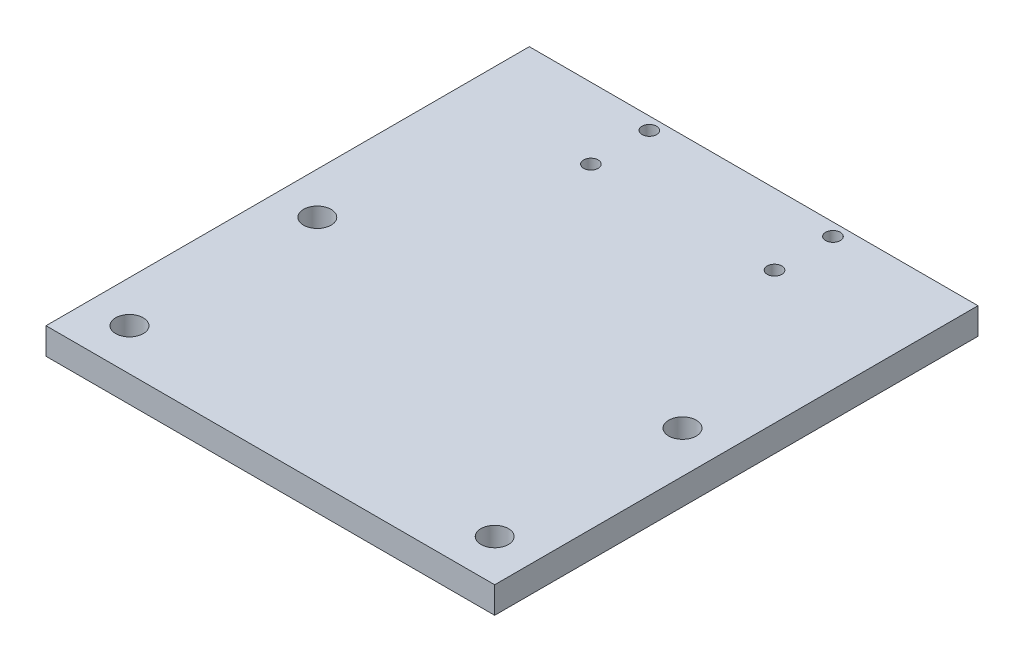
ISO-10303-21;
HEADER;
FILE_DESCRIPTION(('STEP AP214'),'2;1');
FILE_NAME('part.step','',(''),(''),'','','');
FILE_SCHEMA(('AUTOMOTIVE_DESIGN { 1 0 10303 214 1 1 1 1 }'));
ENDSEC;
DATA;
#1=APPLICATION_CONTEXT('core data for automotive mechanical design processes');
#2=APPLICATION_PROTOCOL_DEFINITION('international standard','automotive_design',2000,#1);
#3=PRODUCT_CONTEXT('',#1,'mechanical');
#4=PRODUCT('Part','Part','',(#3));
#5=PRODUCT_RELATED_PRODUCT_CATEGORY('part','',(#4));
#6=PRODUCT_DEFINITION_FORMATION('','',#4);
#7=PRODUCT_DEFINITION_CONTEXT('part definition',#1,'design');
#8=PRODUCT_DEFINITION('design','',#6,#7);
#9=PRODUCT_DEFINITION_SHAPE('','',#8);
#10=(LENGTH_UNIT() NAMED_UNIT(*) SI_UNIT(.MILLI.,.METRE.));
#11=(NAMED_UNIT(*) PLANE_ANGLE_UNIT() SI_UNIT($,.RADIAN.));
#12=(NAMED_UNIT(*) SI_UNIT($,.STERADIAN.) SOLID_ANGLE_UNIT());
#13=UNCERTAINTY_MEASURE_WITH_UNIT(LENGTH_MEASURE(1.E-05),#10,'distance_accuracy_value','');
#14=(GEOMETRIC_REPRESENTATION_CONTEXT(3) GLOBAL_UNCERTAINTY_ASSIGNED_CONTEXT((#13)) GLOBAL_UNIT_ASSIGNED_CONTEXT((#10,
#11,#12)) REPRESENTATION_CONTEXT('',''));
#15=CARTESIAN_POINT('',(0.,0.,0.));
#16=DIRECTION('',(0.,0.,1.));
#17=DIRECTION('',(1.,0.,0.));
#18=AXIS2_PLACEMENT_3D('',#15,#16,#17);
#19=CARTESIAN_POINT('',(0.,6.35,0.));
#20=DIRECTION('',(0.,-1.,0.));
#21=DIRECTION('',(0.,0.,-1.));
#22=AXIS2_PLACEMENT_3D('',#19,#20,#21);
#23=PLANE('',#22);
#24=DIRECTION('',(0.,0.,1.));
#25=VECTOR('',#24,1.);
#26=CARTESIAN_POINT('',(0.,6.35,0.));
#27=LINE('',#26,#25);
#28=CARTESIAN_POINT('',(0.,6.35,-115.8));
#29=VERTEX_POINT('',#28);
#30=CARTESIAN_POINT('',(0.,6.35,0.));
#31=VERTEX_POINT('',#30);
#32=EDGE_CURVE('E96',#29,#31,#27,.T.);
#33=ORIENTED_EDGE('',*,*,#32,.T.);
#34=DIRECTION('',(1.,0.,0.));
#35=VECTOR('',#34,1.);
#36=CARTESIAN_POINT('',(0.,6.35,0.));
#37=LINE('',#36,#35);
#38=CARTESIAN_POINT('',(107.5,6.35,0.));
#39=VERTEX_POINT('',#38);
#40=EDGE_CURVE('E91',#31,#39,#37,.T.);
#41=ORIENTED_EDGE('',*,*,#40,.T.);
#42=DIRECTION('',(0.,0.,-1.));
#43=VECTOR('',#42,1.);
#44=CARTESIAN_POINT('',(107.5,6.35,0.));
#45=LINE('',#44,#43);
#46=CARTESIAN_POINT('',(107.5,6.35,-115.8));
#47=VERTEX_POINT('',#46);
#48=EDGE_CURVE('E94',#39,#47,#45,.T.);
#49=ORIENTED_EDGE('',*,*,#48,.T.);
#50=DIRECTION('',(-1.,0.,0.));
#51=VECTOR('',#50,1.);
#52=CARTESIAN_POINT('',(0.,6.35,-115.8));
#53=LINE('',#52,#51);
#54=EDGE_CURVE('E61',#47,#29,#53,.T.);
#55=ORIENTED_EDGE('',*,*,#54,.T.);
#56=EDGE_LOOP('',(#33,#41,#49,#55));
#57=FACE_BOUND('',#56,.T.);
#58=CARTESIAN_POINT('',(31.75,6.35,-112.8));
#59=DIRECTION('',(0.,1.,0.));
#60=DIRECTION('',(0.,0.,1.));
#61=AXIS2_PLACEMENT_3D('',#58,#59,#60);
#62=CIRCLE('',#61,1.75);
#63=CARTESIAN_POINT('',(31.75,6.35,-111.05));
#64=VERTEX_POINT('',#63);
#65=EDGE_CURVE('E116',#64,#64,#62,.T.);
#66=ORIENTED_EDGE('',*,*,#65,.F.);
#67=EDGE_LOOP('',(#66));
#68=FACE_BOUND('',#67,.T.);
#69=CARTESIAN_POINT('',(75.75,6.35,-98.8));
#70=DIRECTION('',(0.,1.,0.));
#71=DIRECTION('',(0.,0.,1.));
#72=AXIS2_PLACEMENT_3D('',#69,#70,#71);
#73=CIRCLE('',#72,1.75);
#74=CARTESIAN_POINT('',(75.75,6.35,-97.05));
#75=VERTEX_POINT('',#74);
#76=EDGE_CURVE('E138',#75,#75,#73,.T.);
#77=ORIENTED_EDGE('',*,*,#76,.F.);
#78=EDGE_LOOP('',(#77));
#79=FACE_BOUND('',#78,.T.);
#80=CARTESIAN_POINT('',(31.75,6.35,-98.8));
#81=DIRECTION('',(0.,1.,0.));
#82=DIRECTION('',(0.,0.,1.));
#83=AXIS2_PLACEMENT_3D('',#80,#81,#82);
#84=CIRCLE('',#83,1.75);
#85=CARTESIAN_POINT('',(31.75,6.35,-97.05));
#86=VERTEX_POINT('',#85);
#87=EDGE_CURVE('E146',#86,#86,#84,.T.);
#88=ORIENTED_EDGE('',*,*,#87,.F.);
#89=EDGE_LOOP('',(#88));
#90=FACE_BOUND('',#89,.T.);
#91=CARTESIAN_POINT('',(75.75,6.35,-112.8));
#92=DIRECTION('',(0.,1.,0.));
#93=DIRECTION('',(0.,0.,1.));
#94=AXIS2_PLACEMENT_3D('',#91,#92,#93);
#95=CIRCLE('',#94,1.75);
#96=CARTESIAN_POINT('',(75.75,6.35,-111.05));
#97=VERTEX_POINT('',#96);
#98=EDGE_CURVE('E154',#97,#97,#95,.T.);
#99=ORIENTED_EDGE('',*,*,#98,.F.);
#100=EDGE_LOOP('',(#99));
#101=FACE_BOUND('',#100,.T.);
#102=CARTESIAN_POINT('',(10.,6.35,-55.));
#103=DIRECTION('',(0.,1.,0.));
#104=DIRECTION('',(0.,0.,1.));
#105=AXIS2_PLACEMENT_3D('',#102,#103,#104);
#106=CIRCLE('',#105,3.3);
#107=CARTESIAN_POINT('',(10.,6.35,-51.7));
#108=VERTEX_POINT('',#107);
#109=EDGE_CURVE('E162',#108,#108,#106,.T.);
#110=ORIENTED_EDGE('',*,*,#109,.F.);
#111=EDGE_LOOP('',(#110));
#112=FACE_BOUND('',#111,.T.);
#113=CARTESIAN_POINT('',(97.5,6.35,-55.));
#114=DIRECTION('',(0.,1.,0.));
#115=DIRECTION('',(0.,0.,1.));
#116=AXIS2_PLACEMENT_3D('',#113,#114,#115);
#117=CIRCLE('',#116,3.3);
#118=CARTESIAN_POINT('',(97.5,6.35,-51.7));
#119=VERTEX_POINT('',#118);
#120=EDGE_CURVE('E170',#119,#119,#117,.T.);
#121=ORIENTED_EDGE('',*,*,#120,.F.);
#122=EDGE_LOOP('',(#121));
#123=FACE_BOUND('',#122,.T.);
#124=CARTESIAN_POINT('',(10.,6.35,-10.));
#125=DIRECTION('',(0.,1.,0.));
#126=DIRECTION('',(0.,0.,1.));
#127=AXIS2_PLACEMENT_3D('',#124,#125,#126);
#128=CIRCLE('',#127,3.3);
#129=CARTESIAN_POINT('',(10.,6.35,-6.7));
#130=VERTEX_POINT('',#129);
#131=EDGE_CURVE('E178',#130,#130,#128,.T.);
#132=ORIENTED_EDGE('',*,*,#131,.F.);
#133=EDGE_LOOP('',(#132));
#134=FACE_BOUND('',#133,.T.);
#135=CARTESIAN_POINT('',(97.5,6.35,-10.));
#136=DIRECTION('',(0.,1.,0.));
#137=DIRECTION('',(0.,0.,1.));
#138=AXIS2_PLACEMENT_3D('',#135,#136,#137);
#139=CIRCLE('',#138,3.3);
#140=CARTESIAN_POINT('',(97.5,6.35,-6.7));
#141=VERTEX_POINT('',#140);
#142=EDGE_CURVE('E186',#141,#141,#139,.T.);
#143=ORIENTED_EDGE('',*,*,#142,.F.);
#144=EDGE_LOOP('',(#143));
#145=FACE_BOUND('',#144,.T.);
#146=ADVANCED_FACE('F43',(#57,#68,#79,#90,#101,#112,#123,#134,#145),#23,.F.);
#147=CARTESIAN_POINT('',(0.,0.,0.));
#148=DIRECTION('',(0.,-1.,0.));
#149=DIRECTION('',(0.,0.,-1.));
#150=AXIS2_PLACEMENT_3D('',#147,#148,#149);
#151=PLANE('',#150);
#152=CARTESIAN_POINT('',(10.,0.,-10.));
#153=DIRECTION('',(0.,1.,0.));
#154=DIRECTION('',(0.,0.,1.));
#155=AXIS2_PLACEMENT_3D('',#152,#153,#154);
#156=CIRCLE('',#155,3.3);
#157=CARTESIAN_POINT('',(10.,0.,-6.7));
#158=VERTEX_POINT('',#157);
#159=EDGE_CURVE('E182',#158,#158,#156,.T.);
#160=ORIENTED_EDGE('',*,*,#159,.T.);
#161=EDGE_LOOP('',(#160));
#162=FACE_BOUND('',#161,.T.);
#163=CARTESIAN_POINT('',(10.,0.,-55.));
#164=DIRECTION('',(0.,1.,0.));
#165=DIRECTION('',(0.,0.,1.));
#166=AXIS2_PLACEMENT_3D('',#163,#164,#165);
#167=CIRCLE('',#166,3.3);
#168=CARTESIAN_POINT('',(10.,0.,-51.7));
#169=VERTEX_POINT('',#168);
#170=EDGE_CURVE('E166',#169,#169,#167,.T.);
#171=ORIENTED_EDGE('',*,*,#170,.T.);
#172=EDGE_LOOP('',(#171));
#173=FACE_BOUND('',#172,.T.);
#174=CARTESIAN_POINT('',(31.75,0.,-98.8));
#175=DIRECTION('',(0.,1.,0.));
#176=DIRECTION('',(0.,0.,1.));
#177=AXIS2_PLACEMENT_3D('',#174,#175,#176);
#178=CIRCLE('',#177,1.75);
#179=CARTESIAN_POINT('',(31.75,0.,-97.05));
#180=VERTEX_POINT('',#179);
#181=EDGE_CURVE('E150',#180,#180,#178,.T.);
#182=ORIENTED_EDGE('',*,*,#181,.T.);
#183=EDGE_LOOP('',(#182));
#184=FACE_BOUND('',#183,.T.);
#185=CARTESIAN_POINT('',(31.75,0.,-112.8));
#186=DIRECTION('',(0.,1.,0.));
#187=DIRECTION('',(0.,0.,1.));
#188=AXIS2_PLACEMENT_3D('',#185,#186,#187);
#189=CIRCLE('',#188,1.75);
#190=CARTESIAN_POINT('',(31.75,0.,-111.05));
#191=VERTEX_POINT('',#190);
#192=EDGE_CURVE('E134',#191,#191,#189,.T.);
#193=ORIENTED_EDGE('',*,*,#192,.T.);
#194=EDGE_LOOP('',(#193));
#195=FACE_BOUND('',#194,.T.);
#196=DIRECTION('',(0.,0.,1.));
#197=VECTOR('',#196,1.);
#198=CARTESIAN_POINT('',(0.,0.,0.));
#199=LINE('',#198,#197);
#200=CARTESIAN_POINT('',(0.,0.,-115.8));
#201=VERTEX_POINT('',#200);
#202=CARTESIAN_POINT('',(0.,0.,0.));
#203=VERTEX_POINT('',#202);
#204=EDGE_CURVE('E112',#201,#203,#199,.T.);
#205=ORIENTED_EDGE('',*,*,#204,.F.);
#206=DIRECTION('',(-1.,0.,0.));
#207=VECTOR('',#206,1.);
#208=CARTESIAN_POINT('',(0.,0.,-115.8));
#209=LINE('',#208,#207);
#210=CARTESIAN_POINT('',(107.5,0.,-115.8));
#211=VERTEX_POINT('',#210);
#212=EDGE_CURVE('E84',#211,#201,#209,.T.);
#213=ORIENTED_EDGE('',*,*,#212,.F.);
#214=DIRECTION('',(0.,0.,-1.));
#215=VECTOR('',#214,1.);
#216=CARTESIAN_POINT('',(107.5,0.,0.));
#217=LINE('',#216,#215);
#218=CARTESIAN_POINT('',(107.5,0.,0.));
#219=VERTEX_POINT('',#218);
#220=EDGE_CURVE('E78',#219,#211,#217,.T.);
#221=ORIENTED_EDGE('',*,*,#220,.F.);
#222=DIRECTION('',(1.,0.,0.));
#223=VECTOR('',#222,1.);
#224=CARTESIAN_POINT('',(0.,0.,0.));
#225=LINE('',#224,#223);
#226=EDGE_CURVE('E101',#203,#219,#225,.T.);
#227=ORIENTED_EDGE('',*,*,#226,.F.);
#228=EDGE_LOOP('',(#205,#213,#221,#227));
#229=FACE_BOUND('',#228,.T.);
#230=CARTESIAN_POINT('',(75.75,0.,-98.8));
#231=DIRECTION('',(0.,1.,0.));
#232=DIRECTION('',(0.,0.,1.));
#233=AXIS2_PLACEMENT_3D('',#230,#231,#232);
#234=CIRCLE('',#233,1.75);
#235=CARTESIAN_POINT('',(75.75,0.,-97.05));
#236=VERTEX_POINT('',#235);
#237=EDGE_CURVE('E142',#236,#236,#234,.T.);
#238=ORIENTED_EDGE('',*,*,#237,.T.);
#239=EDGE_LOOP('',(#238));
#240=FACE_BOUND('',#239,.T.);
#241=CARTESIAN_POINT('',(75.75,0.,-112.8));
#242=DIRECTION('',(0.,1.,0.));
#243=DIRECTION('',(0.,0.,1.));
#244=AXIS2_PLACEMENT_3D('',#241,#242,#243);
#245=CIRCLE('',#244,1.75);
#246=CARTESIAN_POINT('',(75.75,0.,-111.05));
#247=VERTEX_POINT('',#246);
#248=EDGE_CURVE('E158',#247,#247,#245,.T.);
#249=ORIENTED_EDGE('',*,*,#248,.T.);
#250=EDGE_LOOP('',(#249));
#251=FACE_BOUND('',#250,.T.);
#252=CARTESIAN_POINT('',(97.5,0.,-55.));
#253=DIRECTION('',(0.,1.,0.));
#254=DIRECTION('',(0.,0.,1.));
#255=AXIS2_PLACEMENT_3D('',#252,#253,#254);
#256=CIRCLE('',#255,3.3);
#257=CARTESIAN_POINT('',(97.5,0.,-51.7));
#258=VERTEX_POINT('',#257);
#259=EDGE_CURVE('E174',#258,#258,#256,.T.);
#260=ORIENTED_EDGE('',*,*,#259,.T.);
#261=EDGE_LOOP('',(#260));
#262=FACE_BOUND('',#261,.T.);
#263=CARTESIAN_POINT('',(97.5,0.,-10.));
#264=DIRECTION('',(0.,1.,0.));
#265=DIRECTION('',(0.,0.,1.));
#266=AXIS2_PLACEMENT_3D('',#263,#264,#265);
#267=CIRCLE('',#266,3.3);
#268=CARTESIAN_POINT('',(97.5,0.,-6.7));
#269=VERTEX_POINT('',#268);
#270=EDGE_CURVE('E190',#269,#269,#267,.T.);
#271=ORIENTED_EDGE('',*,*,#270,.T.);
#272=EDGE_LOOP('',(#271));
#273=FACE_BOUND('',#272,.T.);
#274=ADVANCED_FACE('F129',(#162,#173,#184,#195,#229,#240,#251,#262,#273),#151,.T.);
#275=CARTESIAN_POINT('',(0.,6.35,0.));
#276=DIRECTION('',(1.,0.,0.));
#277=DIRECTION('',(0.,0.,-1.));
#278=AXIS2_PLACEMENT_3D('',#275,#276,#277);
#279=PLANE('',#278);
#280=ORIENTED_EDGE('',*,*,#204,.T.);
#281=DIRECTION('',(0.,-1.,0.));
#282=VECTOR('',#281,1.);
#283=CARTESIAN_POINT('',(0.,6.35,0.));
#284=LINE('',#283,#282);
#285=EDGE_CURVE('E11',#31,#203,#284,.T.);
#286=ORIENTED_EDGE('',*,*,#285,.F.);
#287=ORIENTED_EDGE('',*,*,#32,.F.);
#288=DIRECTION('',(0.,-1.,0.));
#289=VECTOR('',#288,1.);
#290=CARTESIAN_POINT('',(0.,6.35,-115.8));
#291=LINE('',#290,#289);
#292=EDGE_CURVE('E108',#29,#201,#291,.T.);
#293=ORIENTED_EDGE('',*,*,#292,.T.);
#294=EDGE_LOOP('',(#280,#286,#287,#293));
#295=FACE_BOUND('',#294,.T.);
#296=ADVANCED_FACE('F45',(#295),#279,.F.);
#297=CARTESIAN_POINT('',(0.,6.35,0.));
#298=DIRECTION('',(0.,0.,-1.));
#299=DIRECTION('',(-1.,0.,0.));
#300=AXIS2_PLACEMENT_3D('',#297,#298,#299);
#301=PLANE('',#300);
#302=ORIENTED_EDGE('',*,*,#226,.T.);
#303=DIRECTION('',(0.,-1.,0.));
#304=VECTOR('',#303,1.);
#305=CARTESIAN_POINT('',(107.5,6.35,0.));
#306=LINE('',#305,#304);
#307=EDGE_CURVE('E53',#39,#219,#306,.T.);
#308=ORIENTED_EDGE('',*,*,#307,.F.);
#309=ORIENTED_EDGE('',*,*,#40,.F.);
#310=ORIENTED_EDGE('',*,*,#285,.T.);
#311=EDGE_LOOP('',(#302,#308,#309,#310));
#312=FACE_BOUND('',#311,.T.);
#313=ADVANCED_FACE('F100',(#312),#301,.F.);
#314=CARTESIAN_POINT('',(107.5,6.35,0.));
#315=DIRECTION('',(-1.,0.,0.));
#316=DIRECTION('',(0.,0.,1.));
#317=AXIS2_PLACEMENT_3D('',#314,#315,#316);
#318=PLANE('',#317);
#319=ORIENTED_EDGE('',*,*,#220,.T.);
#320=DIRECTION('',(0.,-1.,0.));
#321=VECTOR('',#320,1.);
#322=CARTESIAN_POINT('',(107.5,6.35,-115.8));
#323=LINE('',#322,#321);
#324=EDGE_CURVE('E103',#47,#211,#323,.T.);
#325=ORIENTED_EDGE('',*,*,#324,.F.);
#326=ORIENTED_EDGE('',*,*,#48,.F.);
#327=ORIENTED_EDGE('',*,*,#307,.T.);
#328=EDGE_LOOP('',(#319,#325,#326,#327));
#329=FACE_BOUND('',#328,.T.);
#330=ADVANCED_FACE('F104',(#329),#318,.F.);
#331=CARTESIAN_POINT('',(0.,6.35,-115.8));
#332=DIRECTION('',(0.,0.,1.));
#333=DIRECTION('',(1.,0.,0.));
#334=AXIS2_PLACEMENT_3D('',#331,#332,#333);
#335=PLANE('',#334);
#336=ORIENTED_EDGE('',*,*,#212,.T.);
#337=ORIENTED_EDGE('',*,*,#292,.F.);
#338=ORIENTED_EDGE('',*,*,#54,.F.);
#339=ORIENTED_EDGE('',*,*,#324,.T.);
#340=EDGE_LOOP('',(#336,#337,#338,#339));
#341=FACE_BOUND('',#340,.T.);
#342=ADVANCED_FACE('F126',(#341),#335,.F.);
#343=CARTESIAN_POINT('',(31.75,6.35,-112.8));
#344=DIRECTION('',(0.,-1.,0.));
#345=DIRECTION('',(0.,0.,-1.));
#346=AXIS2_PLACEMENT_3D('',#343,#344,#345);
#347=CYLINDRICAL_SURFACE('',#346,1.75);
#348=ORIENTED_EDGE('',*,*,#65,.T.);
#349=EDGE_LOOP('',(#348));
#350=FACE_BOUND('',#349,.T.);
#351=ORIENTED_EDGE('',*,*,#192,.F.);
#352=EDGE_LOOP('',(#351));
#353=FACE_BOUND('',#352,.T.);
#354=ADVANCED_FACE('F209',(#350,#353),#347,.F.);
#355=CARTESIAN_POINT('',(75.75,6.35,-98.8));
#356=DIRECTION('',(0.,-1.,0.));
#357=DIRECTION('',(0.,0.,-1.));
#358=AXIS2_PLACEMENT_3D('',#355,#356,#357);
#359=CYLINDRICAL_SURFACE('',#358,1.75);
#360=ORIENTED_EDGE('',*,*,#76,.T.);
#361=EDGE_LOOP('',(#360));
#362=FACE_BOUND('',#361,.T.);
#363=ORIENTED_EDGE('',*,*,#237,.F.);
#364=EDGE_LOOP('',(#363));
#365=FACE_BOUND('',#364,.T.);
#366=ADVANCED_FACE('F263',(#362,#365),#359,.F.);
#367=CARTESIAN_POINT('',(31.75,6.35,-98.8));
#368=DIRECTION('',(0.,-1.,0.));
#369=DIRECTION('',(0.,0.,-1.));
#370=AXIS2_PLACEMENT_3D('',#367,#368,#369);
#371=CYLINDRICAL_SURFACE('',#370,1.75);
#372=ORIENTED_EDGE('',*,*,#87,.T.);
#373=EDGE_LOOP('',(#372));
#374=FACE_BOUND('',#373,.T.);
#375=ORIENTED_EDGE('',*,*,#181,.F.);
#376=EDGE_LOOP('',(#375));
#377=FACE_BOUND('',#376,.T.);
#378=ADVANCED_FACE('F272',(#374,#377),#371,.F.);
#379=CARTESIAN_POINT('',(75.75,6.35,-112.8));
#380=DIRECTION('',(0.,-1.,0.));
#381=DIRECTION('',(0.,0.,-1.));
#382=AXIS2_PLACEMENT_3D('',#379,#380,#381);
#383=CYLINDRICAL_SURFACE('',#382,1.75);
#384=ORIENTED_EDGE('',*,*,#98,.T.);
#385=EDGE_LOOP('',(#384));
#386=FACE_BOUND('',#385,.T.);
#387=ORIENTED_EDGE('',*,*,#248,.F.);
#388=EDGE_LOOP('',(#387));
#389=FACE_BOUND('',#388,.T.);
#390=ADVANCED_FACE('F281',(#386,#389),#383,.F.);
#391=CARTESIAN_POINT('',(10.,6.35,-55.));
#392=DIRECTION('',(0.,-1.,0.));
#393=DIRECTION('',(0.,0.,-1.));
#394=AXIS2_PLACEMENT_3D('',#391,#392,#393);
#395=CYLINDRICAL_SURFACE('',#394,3.3);
#396=ORIENTED_EDGE('',*,*,#109,.T.);
#397=EDGE_LOOP('',(#396));
#398=FACE_BOUND('',#397,.T.);
#399=ORIENTED_EDGE('',*,*,#170,.F.);
#400=EDGE_LOOP('',(#399));
#401=FACE_BOUND('',#400,.T.);
#402=ADVANCED_FACE('F291',(#398,#401),#395,.F.);
#403=CARTESIAN_POINT('',(97.5,6.35,-55.));
#404=DIRECTION('',(0.,-1.,0.));
#405=DIRECTION('',(0.,0.,-1.));
#406=AXIS2_PLACEMENT_3D('',#403,#404,#405);
#407=CYLINDRICAL_SURFACE('',#406,3.3);
#408=ORIENTED_EDGE('',*,*,#120,.T.);
#409=EDGE_LOOP('',(#408));
#410=FACE_BOUND('',#409,.T.);
#411=ORIENTED_EDGE('',*,*,#259,.F.);
#412=EDGE_LOOP('',(#411));
#413=FACE_BOUND('',#412,.T.);
#414=ADVANCED_FACE('F301',(#410,#413),#407,.F.);
#415=CARTESIAN_POINT('',(10.,6.35,-10.));
#416=DIRECTION('',(0.,-1.,0.));
#417=DIRECTION('',(0.,0.,-1.));
#418=AXIS2_PLACEMENT_3D('',#415,#416,#417);
#419=CYLINDRICAL_SURFACE('',#418,3.3);
#420=ORIENTED_EDGE('',*,*,#131,.T.);
#421=EDGE_LOOP('',(#420));
#422=FACE_BOUND('',#421,.T.);
#423=ORIENTED_EDGE('',*,*,#159,.F.);
#424=EDGE_LOOP('',(#423));
#425=FACE_BOUND('',#424,.T.);
#426=ADVANCED_FACE('F311',(#422,#425),#419,.F.);
#427=CARTESIAN_POINT('',(97.5,6.35,-10.));
#428=DIRECTION('',(0.,-1.,0.));
#429=DIRECTION('',(0.,0.,-1.));
#430=AXIS2_PLACEMENT_3D('',#427,#428,#429);
#431=CYLINDRICAL_SURFACE('',#430,3.3);
#432=ORIENTED_EDGE('',*,*,#142,.T.);
#433=EDGE_LOOP('',(#432));
#434=FACE_BOUND('',#433,.T.);
#435=ORIENTED_EDGE('',*,*,#270,.F.);
#436=EDGE_LOOP('',(#435));
#437=FACE_BOUND('',#436,.T.);
#438=ADVANCED_FACE('F198',(#434,#437),#431,.F.);
#439=CLOSED_SHELL('',(#146,#274,#296,#313,#330,#342,#354,#366,#378,#390,#402,#414,#426,#438));
#440=MANIFOLD_SOLID_BREP('B2',#439);
#441=ADVANCED_BREP_SHAPE_REPRESENTATION('',(#18,#440),#14);
#442=SHAPE_DEFINITION_REPRESENTATION(#9,#441);
ENDSEC;
END-ISO-10303-21;
